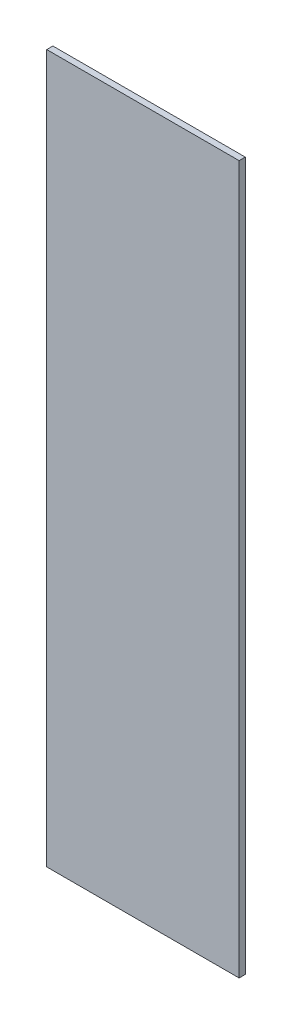
ISO-10303-21;
HEADER;
FILE_DESCRIPTION(('STEP AP214'),'2;1');
FILE_NAME('part.step','',(''),(''),'','','');
FILE_SCHEMA(('AUTOMOTIVE_DESIGN { 1 0 10303 214 1 1 1 1 }'));
ENDSEC;
DATA;
#1=APPLICATION_CONTEXT('core data for automotive mechanical design processes');
#2=APPLICATION_PROTOCOL_DEFINITION('international standard','automotive_design',2000,#1);
#3=PRODUCT_CONTEXT('',#1,'mechanical');
#4=PRODUCT('Part','Part','',(#3));
#5=PRODUCT_RELATED_PRODUCT_CATEGORY('part','',(#4));
#6=PRODUCT_DEFINITION_FORMATION('','',#4);
#7=PRODUCT_DEFINITION_CONTEXT('part definition',#1,'design');
#8=PRODUCT_DEFINITION('design','',#6,#7);
#9=PRODUCT_DEFINITION_SHAPE('','',#8);
#10=(LENGTH_UNIT() NAMED_UNIT(*) SI_UNIT(.MILLI.,.METRE.));
#11=(NAMED_UNIT(*) PLANE_ANGLE_UNIT() SI_UNIT($,.RADIAN.));
#12=(NAMED_UNIT(*) SI_UNIT($,.STERADIAN.) SOLID_ANGLE_UNIT());
#13=UNCERTAINTY_MEASURE_WITH_UNIT(LENGTH_MEASURE(1.E-05),#10,'distance_accuracy_value','');
#14=(GEOMETRIC_REPRESENTATION_CONTEXT(3) GLOBAL_UNCERTAINTY_ASSIGNED_CONTEXT((#13)) GLOBAL_UNIT_ASSIGNED_CONTEXT((#10,
#11,#12)) REPRESENTATION_CONTEXT('',''));
#15=CARTESIAN_POINT('',(0.,0.,0.));
#16=DIRECTION('',(0.,0.,1.));
#17=DIRECTION('',(1.,0.,0.));
#18=AXIS2_PLACEMENT_3D('',#15,#16,#17);
#19=CARTESIAN_POINT('',(0.62500002,2.29972616,0.03999992));
#20=DIRECTION('',(0.,0.,1.));
#21=DIRECTION('',(1.,0.,0.));
#22=AXIS2_PLACEMENT_3D('',#19,#20,#21);
#23=PLANE('',#22);
#24=DIRECTION('',(1.,0.,0.));
#25=VECTOR('',#24,1.);
#26=CARTESIAN_POINT('',(-0.62500002,2.29972616,0.03999992));
#27=LINE('',#26,#25);
#28=CARTESIAN_POINT('',(-0.62500002,2.29972616,0.03999992));
#29=VERTEX_POINT('',#28);
#30=CARTESIAN_POINT('',(0.62500002,2.29972616,0.03999992));
#31=VERTEX_POINT('',#30);
#32=EDGE_CURVE('E27',#29,#31,#27,.T.);
#33=ORIENTED_EDGE('',*,*,#32,.F.);
#34=DIRECTION('',(0.,1.,0.));
#35=VECTOR('',#34,1.);
#36=CARTESIAN_POINT('',(-0.62500002,-2.29972362,0.03999992));
#37=LINE('',#36,#35);
#38=CARTESIAN_POINT('',(-0.62500002,-2.29972362,0.03999992));
#39=VERTEX_POINT('',#38);
#40=EDGE_CURVE('E70',#39,#29,#37,.T.);
#41=ORIENTED_EDGE('',*,*,#40,.F.);
#42=DIRECTION('',(-1.,0.,0.));
#43=VECTOR('',#42,1.);
#44=CARTESIAN_POINT('',(0.62500002,-2.29972362,0.03999992));
#45=LINE('',#44,#43);
#46=CARTESIAN_POINT('',(0.62500002,-2.29972362,0.03999992));
#47=VERTEX_POINT('',#46);
#48=EDGE_CURVE('E20',#47,#39,#45,.T.);
#49=ORIENTED_EDGE('',*,*,#48,.F.);
#50=DIRECTION('',(0.,-1.,0.));
#51=VECTOR('',#50,1.);
#52=CARTESIAN_POINT('',(0.62500002,2.29972616,0.03999992));
#53=LINE('',#52,#51);
#54=EDGE_CURVE('E67',#31,#47,#53,.T.);
#55=ORIENTED_EDGE('',*,*,#54,.F.);
#56=EDGE_LOOP('',(#33,#41,#49,#55));
#57=FACE_BOUND('',#56,.T.);
#58=ADVANCED_FACE('F16',(#57),#23,.T.);
#59=CARTESIAN_POINT('',(0.62500002,2.29972616,0.));
#60=DIRECTION('',(0.,0.,1.));
#61=DIRECTION('',(1.,0.,0.));
#62=AXIS2_PLACEMENT_3D('',#59,#60,#61);
#63=PLANE('',#62);
#64=DIRECTION('',(0.,-1.,0.));
#65=VECTOR('',#64,1.);
#66=CARTESIAN_POINT('',(0.62500002,2.29972616,0.));
#67=LINE('',#66,#65);
#68=CARTESIAN_POINT('',(0.62500002,2.29972616,0.));
#69=VERTEX_POINT('',#68);
#70=CARTESIAN_POINT('',(0.62500002,-2.29972362,0.));
#71=VERTEX_POINT('',#70);
#72=EDGE_CURVE('E76',#69,#71,#67,.T.);
#73=ORIENTED_EDGE('',*,*,#72,.T.);
#74=DIRECTION('',(-1.,0.,0.));
#75=VECTOR('',#74,1.);
#76=CARTESIAN_POINT('',(0.62500002,-2.29972362,0.));
#77=LINE('',#76,#75);
#78=CARTESIAN_POINT('',(-0.62500002,-2.29972362,0.));
#79=VERTEX_POINT('',#78);
#80=EDGE_CURVE('E81',#71,#79,#77,.T.);
#81=ORIENTED_EDGE('',*,*,#80,.T.);
#82=DIRECTION('',(0.,1.,0.));
#83=VECTOR('',#82,1.);
#84=CARTESIAN_POINT('',(-0.62500002,-2.29972362,0.));
#85=LINE('',#84,#83);
#86=CARTESIAN_POINT('',(-0.62500002,2.29972616,0.));
#87=VERTEX_POINT('',#86);
#88=EDGE_CURVE('E100',#79,#87,#85,.T.);
#89=ORIENTED_EDGE('',*,*,#88,.T.);
#90=DIRECTION('',(1.,0.,0.));
#91=VECTOR('',#90,1.);
#92=CARTESIAN_POINT('',(-0.62500002,2.29972616,0.));
#93=LINE('',#92,#91);
#94=EDGE_CURVE('E10',#87,#69,#93,.T.);
#95=ORIENTED_EDGE('',*,*,#94,.T.);
#96=EDGE_LOOP('',(#73,#81,#89,#95));
#97=FACE_BOUND('',#96,.T.);
#98=ADVANCED_FACE('F18',(#97),#63,.F.);
#99=CARTESIAN_POINT('',(-0.62500002,2.29972616,0.));
#100=DIRECTION('',(0.,1.,0.));
#101=DIRECTION('',(1.,0.,0.));
#102=AXIS2_PLACEMENT_3D('',#99,#100,#101);
#103=PLANE('',#102);
#104=DIRECTION('',(0.,0.,1.));
#105=VECTOR('',#104,1.);
#106=CARTESIAN_POINT('',(-0.62500002,2.29972616,0.));
#107=LINE('',#106,#105);
#108=EDGE_CURVE('E99',#87,#29,#107,.T.);
#109=ORIENTED_EDGE('',*,*,#108,.T.);
#110=ORIENTED_EDGE('',*,*,#32,.T.);
#111=DIRECTION('',(0.,0.,1.));
#112=VECTOR('',#111,1.);
#113=CARTESIAN_POINT('',(0.62500002,2.29972616,0.));
#114=LINE('',#113,#112);
#115=EDGE_CURVE('E88',#69,#31,#114,.T.);
#116=ORIENTED_EDGE('',*,*,#115,.F.);
#117=ORIENTED_EDGE('',*,*,#94,.F.);
#118=EDGE_LOOP('',(#109,#110,#116,#117));
#119=FACE_BOUND('',#118,.T.);
#120=ADVANCED_FACE('F119',(#119),#103,.T.);
#121=CARTESIAN_POINT('',(-0.62500002,-2.29972362,0.));
#122=DIRECTION('',(-1.,0.,0.));
#123=DIRECTION('',(0.,0.,1.));
#124=AXIS2_PLACEMENT_3D('',#121,#122,#123);
#125=PLANE('',#124);
#126=DIRECTION('',(0.,0.,1.));
#127=VECTOR('',#126,1.);
#128=CARTESIAN_POINT('',(-0.62500002,-2.29972362,0.));
#129=LINE('',#128,#127);
#130=EDGE_CURVE('E75',#79,#39,#129,.T.);
#131=ORIENTED_EDGE('',*,*,#130,.T.);
#132=ORIENTED_EDGE('',*,*,#40,.T.);
#133=ORIENTED_EDGE('',*,*,#108,.F.);
#134=ORIENTED_EDGE('',*,*,#88,.F.);
#135=EDGE_LOOP('',(#131,#132,#133,#134));
#136=FACE_BOUND('',#135,.T.);
#137=ADVANCED_FACE('F118',(#136),#125,.T.);
#138=CARTESIAN_POINT('',(0.62500002,-2.29972362,0.));
#139=DIRECTION('',(0.,-1.,0.));
#140=DIRECTION('',(0.,0.,-1.));
#141=AXIS2_PLACEMENT_3D('',#138,#139,#140);
#142=PLANE('',#141);
#143=DIRECTION('',(0.,0.,1.));
#144=VECTOR('',#143,1.);
#145=CARTESIAN_POINT('',(0.62500002,-2.29972362,0.));
#146=LINE('',#145,#144);
#147=EDGE_CURVE('E78',#71,#47,#146,.T.);
#148=ORIENTED_EDGE('',*,*,#147,.T.);
#149=ORIENTED_EDGE('',*,*,#48,.T.);
#150=ORIENTED_EDGE('',*,*,#130,.F.);
#151=ORIENTED_EDGE('',*,*,#80,.F.);
#152=EDGE_LOOP('',(#148,#149,#150,#151));
#153=FACE_BOUND('',#152,.T.);
#154=ADVANCED_FACE('F79',(#153),#142,.T.);
#155=CARTESIAN_POINT('',(0.62500002,2.29972616,0.));
#156=DIRECTION('',(1.,0.,0.));
#157=DIRECTION('',(0.,1.,0.));
#158=AXIS2_PLACEMENT_3D('',#155,#156,#157);
#159=PLANE('',#158);
#160=ORIENTED_EDGE('',*,*,#115,.T.);
#161=ORIENTED_EDGE('',*,*,#54,.T.);
#162=ORIENTED_EDGE('',*,*,#147,.F.);
#163=ORIENTED_EDGE('',*,*,#72,.F.);
#164=EDGE_LOOP('',(#160,#161,#162,#163));
#165=FACE_BOUND('',#164,.T.);
#166=ADVANCED_FACE('F87',(#165),#159,.T.);
#167=CLOSED_SHELL('',(#58,#98,#120,#137,#154,#166));
#168=MANIFOLD_SOLID_BREP('B1',#167);
#169=ADVANCED_BREP_SHAPE_REPRESENTATION('',(#18,#168),#14);
#170=SHAPE_DEFINITION_REPRESENTATION(#9,#169);
ENDSEC;
END-ISO-10303-21;
